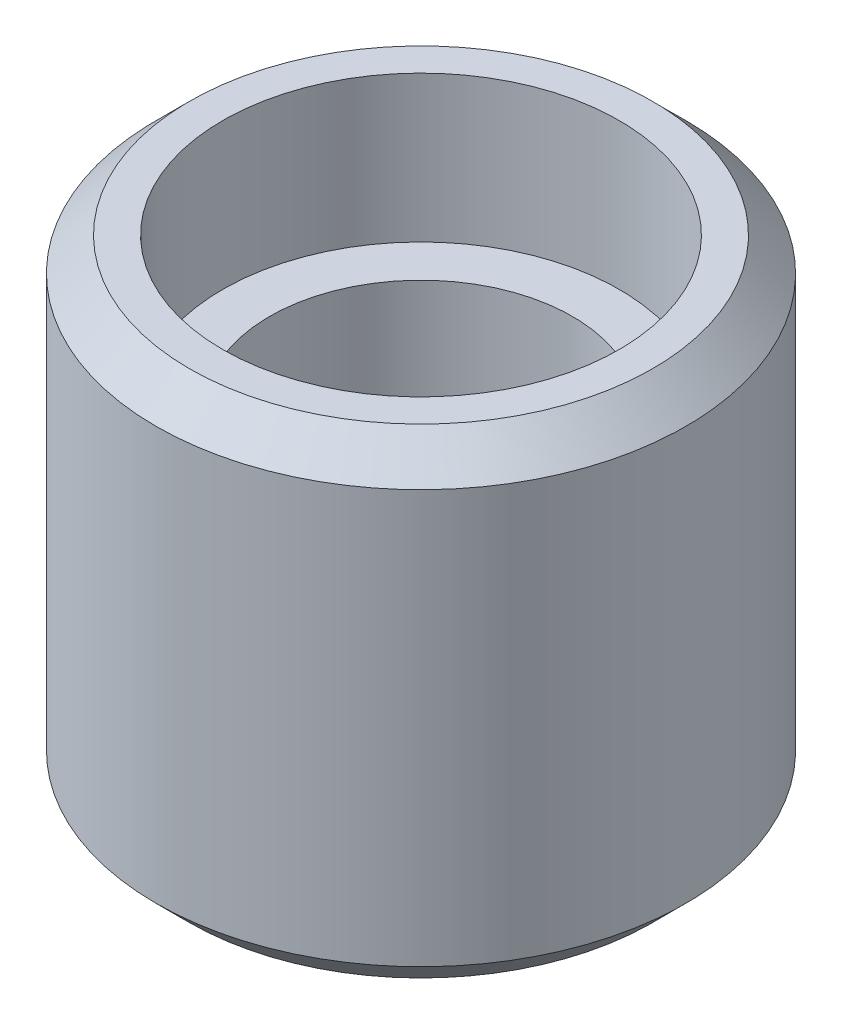
ISO-10303-21;
HEADER;
FILE_DESCRIPTION(('STEP AP214'),'2;1');
FILE_NAME('part.step','',(''),(''),'','','');
FILE_SCHEMA(('AUTOMOTIVE_DESIGN { 1 0 10303 214 1 1 1 1 }'));
ENDSEC;
DATA;
#1=APPLICATION_CONTEXT('core data for automotive mechanical design processes');
#2=APPLICATION_PROTOCOL_DEFINITION('international standard','automotive_design',2000,#1);
#3=PRODUCT_CONTEXT('',#1,'mechanical');
#4=PRODUCT('Part','Part','',(#3));
#5=PRODUCT_RELATED_PRODUCT_CATEGORY('part','',(#4));
#6=PRODUCT_DEFINITION_FORMATION('','',#4);
#7=PRODUCT_DEFINITION_CONTEXT('part definition',#1,'design');
#8=PRODUCT_DEFINITION('design','',#6,#7);
#9=PRODUCT_DEFINITION_SHAPE('','',#8);
#10=(LENGTH_UNIT() NAMED_UNIT(*) SI_UNIT(.MILLI.,.METRE.));
#11=(NAMED_UNIT(*) PLANE_ANGLE_UNIT() SI_UNIT($,.RADIAN.));
#12=(NAMED_UNIT(*) SI_UNIT($,.STERADIAN.) SOLID_ANGLE_UNIT());
#13=UNCERTAINTY_MEASURE_WITH_UNIT(LENGTH_MEASURE(1.E-05),#10,'distance_accuracy_value','');
#14=(GEOMETRIC_REPRESENTATION_CONTEXT(3) GLOBAL_UNCERTAINTY_ASSIGNED_CONTEXT((#13)) GLOBAL_UNIT_ASSIGNED_CONTEXT((#10,
#11,#12)) REPRESENTATION_CONTEXT('',''));
#15=CARTESIAN_POINT('',(0.,0.,0.));
#16=DIRECTION('',(0.,0.,1.));
#17=DIRECTION('',(1.,0.,0.));
#18=AXIS2_PLACEMENT_3D('',#15,#16,#17);
#19=CARTESIAN_POINT('',(0.,0.,0.));
#20=DIRECTION('',(0.,-1.,0.));
#21=DIRECTION('',(0.,0.,1.));
#22=AXIS2_PLACEMENT_3D('',#19,#20,#21);
#23=PLANE('',#22);
#24=CARTESIAN_POINT('',(0.,0.,0.));
#25=DIRECTION('',(0.,-1.,0.));
#26=DIRECTION('',(0.,0.,1.));
#27=AXIS2_PLACEMENT_3D('',#24,#25,#26);
#28=CIRCLE('',#27,12.95);
#29=CARTESIAN_POINT('',(0.,0.,12.95));
#30=VERTEX_POINT('',#29);
#31=EDGE_CURVE('E50',#30,#30,#28,.T.);
#32=ORIENTED_EDGE('',*,*,#31,.F.);
#33=EDGE_LOOP('',(#32));
#34=FACE_BOUND('',#33,.T.);
#35=CARTESIAN_POINT('',(0.,0.,0.));
#36=DIRECTION('',(0.,-1.,0.));
#37=DIRECTION('',(0.,0.,1.));
#38=AXIS2_PLACEMENT_3D('',#35,#36,#37);
#39=CIRCLE('',#38,19.795);
#40=CARTESIAN_POINT('',(0.,0.,19.795));
#41=VERTEX_POINT('',#40);
#42=EDGE_CURVE('E46',#41,#41,#39,.T.);
#43=ORIENTED_EDGE('',*,*,#42,.T.);
#44=EDGE_LOOP('',(#43));
#45=FACE_BOUND('',#44,.T.);
#46=ADVANCED_FACE('F15',(#34,#45),#23,.T.);
#47=CARTESIAN_POINT('',(0.,28.5,0.));
#48=DIRECTION('',(0.,-1.,0.));
#49=DIRECTION('',(0.,0.,1.));
#50=AXIS2_PLACEMENT_3D('',#47,#48,#49);
#51=PLANE('',#50);
#52=CARTESIAN_POINT('',(0.,28.5,0.));
#53=DIRECTION('',(0.,-1.,0.));
#54=DIRECTION('',(0.,0.,1.));
#55=AXIS2_PLACEMENT_3D('',#52,#53,#54);
#56=CIRCLE('',#55,12.95);
#57=CARTESIAN_POINT('',(0.,28.5,12.95));
#58=VERTEX_POINT('',#57);
#59=EDGE_CURVE('E18',#58,#58,#56,.T.);
#60=ORIENTED_EDGE('',*,*,#59,.T.);
#61=EDGE_LOOP('',(#60));
#62=FACE_BOUND('',#61,.T.);
#63=CARTESIAN_POINT('',(0.,28.5,0.));
#64=DIRECTION('',(0.,-1.,0.));
#65=DIRECTION('',(0.,0.,1.));
#66=AXIS2_PLACEMENT_3D('',#63,#64,#65);
#67=CIRCLE('',#66,16.95);
#68=CARTESIAN_POINT('',(0.,28.5,16.95));
#69=VERTEX_POINT('',#68);
#70=EDGE_CURVE('E10',#69,#69,#67,.T.);
#71=ORIENTED_EDGE('',*,*,#70,.F.);
#72=EDGE_LOOP('',(#71));
#73=FACE_BOUND('',#72,.T.);
#74=ADVANCED_FACE('F62',(#62,#73),#51,.F.);
#75=CARTESIAN_POINT('',(0.,0.,0.));
#76=DIRECTION('',(0.,-1.,0.));
#77=DIRECTION('',(0.,0.,1.));
#78=AXIS2_PLACEMENT_3D('',#75,#76,#77);
#79=CYLINDRICAL_SURFACE('',#78,16.95);
#80=CARTESIAN_POINT('',(0.,41.,0.));
#81=DIRECTION('',(0.,-1.,0.));
#82=DIRECTION('',(0.,0.,1.));
#83=AXIS2_PLACEMENT_3D('',#80,#81,#82);
#84=CIRCLE('',#83,16.95);
#85=CARTESIAN_POINT('',(0.,41.,16.95));
#86=VERTEX_POINT('',#85);
#87=EDGE_CURVE('E23',#86,#86,#84,.T.);
#88=ORIENTED_EDGE('',*,*,#87,.F.);
#89=EDGE_LOOP('',(#88));
#90=FACE_BOUND('',#89,.T.);
#91=ORIENTED_EDGE('',*,*,#70,.T.);
#92=EDGE_LOOP('',(#91));
#93=FACE_BOUND('',#92,.T.);
#94=ADVANCED_FACE('F81',(#90,#93),#79,.F.);
#95=CARTESIAN_POINT('',(-16.95,41.,0.));
#96=DIRECTION('',(0.,-1.,0.));
#97=DIRECTION('',(0.,0.,1.));
#98=AXIS2_PLACEMENT_3D('',#95,#96,#97);
#99=PLANE('',#98);
#100=CARTESIAN_POINT('',(0.,41.,0.));
#101=DIRECTION('',(0.,-1.,0.));
#102=DIRECTION('',(0.,0.,1.));
#103=AXIS2_PLACEMENT_3D('',#100,#101,#102);
#104=CIRCLE('',#103,19.795);
#105=CARTESIAN_POINT('',(0.,41.,19.795));
#106=VERTEX_POINT('',#105);
#107=EDGE_CURVE('E32',#106,#106,#104,.T.);
#108=ORIENTED_EDGE('',*,*,#107,.F.);
#109=EDGE_LOOP('',(#108));
#110=FACE_BOUND('',#109,.T.);
#111=ORIENTED_EDGE('',*,*,#87,.T.);
#112=EDGE_LOOP('',(#111));
#113=FACE_BOUND('',#112,.T.);
#114=ADVANCED_FACE('F88',(#110,#113),#99,.F.);
#115=CARTESIAN_POINT('',(0.,41.,0.));
#116=DIRECTION('',(0.,-1.,0.));
#117=DIRECTION('',(0.,0.,1.));
#118=AXIS2_PLACEMENT_3D('',#115,#116,#117);
#119=CONICAL_SURFACE('',#118,19.795,0.785398163397445);
#120=CARTESIAN_POINT('',(0.,38.155,0.));
#121=DIRECTION('',(0.,-1.,0.));
#122=DIRECTION('',(0.,0.,1.));
#123=AXIS2_PLACEMENT_3D('',#120,#121,#122);
#124=CIRCLE('',#123,22.64);
#125=CARTESIAN_POINT('',(0.,38.155,22.64));
#126=VERTEX_POINT('',#125);
#127=EDGE_CURVE('E38',#126,#126,#124,.T.);
#128=ORIENTED_EDGE('',*,*,#127,.F.);
#129=EDGE_LOOP('',(#128));
#130=FACE_BOUND('',#129,.T.);
#131=ORIENTED_EDGE('',*,*,#107,.T.);
#132=EDGE_LOOP('',(#131));
#133=FACE_BOUND('',#132,.T.);
#134=ADVANCED_FACE('F94',(#130,#133),#119,.T.);
#135=CARTESIAN_POINT('',(0.,0.,0.));
#136=DIRECTION('',(0.,-1.,0.));
#137=DIRECTION('',(0.,0.,1.));
#138=AXIS2_PLACEMENT_3D('',#135,#136,#137);
#139=CYLINDRICAL_SURFACE('',#138,22.64);
#140=ORIENTED_EDGE('',*,*,#127,.T.);
#141=EDGE_LOOP('',(#140));
#142=FACE_BOUND('',#141,.T.);
#143=CARTESIAN_POINT('',(0.,2.845,0.));
#144=DIRECTION('',(0.,-1.,0.));
#145=DIRECTION('',(0.,0.,1.));
#146=AXIS2_PLACEMENT_3D('',#143,#144,#145);
#147=CIRCLE('',#146,22.64);
#148=CARTESIAN_POINT('',(0.,2.845,22.64));
#149=VERTEX_POINT('',#148);
#150=EDGE_CURVE('E42',#149,#149,#147,.T.);
#151=ORIENTED_EDGE('',*,*,#150,.F.);
#152=EDGE_LOOP('',(#151));
#153=FACE_BOUND('',#152,.T.);
#154=ADVANCED_FACE('F73',(#142,#153),#139,.T.);
#155=CARTESIAN_POINT('',(0.,0.,0.));
#156=DIRECTION('',(0.,1.,0.));
#157=DIRECTION('',(0.,0.,-1.));
#158=AXIS2_PLACEMENT_3D('',#155,#156,#157);
#159=CONICAL_SURFACE('',#158,19.795,0.785398163397449);
#160=ORIENTED_EDGE('',*,*,#150,.T.);
#161=EDGE_LOOP('',(#160));
#162=FACE_BOUND('',#161,.T.);
#163=ORIENTED_EDGE('',*,*,#42,.F.);
#164=EDGE_LOOP('',(#163));
#165=FACE_BOUND('',#164,.T.);
#166=ADVANCED_FACE('F67',(#162,#165),#159,.T.);
#167=CARTESIAN_POINT('',(0.,-1.,0.));
#168=DIRECTION('',(0.,1.,0.));
#169=DIRECTION('',(1.,0.,0.));
#170=AXIS2_PLACEMENT_3D('',#167,#168,#169);
#171=CYLINDRICAL_SURFACE('',#170,12.95);
#172=ORIENTED_EDGE('',*,*,#31,.T.);
#173=EDGE_LOOP('',(#172));
#174=FACE_BOUND('',#173,.T.);
#175=ORIENTED_EDGE('',*,*,#59,.F.);
#176=EDGE_LOOP('',(#175));
#177=FACE_BOUND('',#176,.T.);
#178=ADVANCED_FACE('F65',(#174,#177),#171,.F.);
#179=CLOSED_SHELL('',(#46,#74,#94,#114,#134,#154,#166,#178));
#180=MANIFOLD_SOLID_BREP('B1',#179);
#181=ADVANCED_BREP_SHAPE_REPRESENTATION('',(#18,#180),#14);
#182=SHAPE_DEFINITION_REPRESENTATION(#9,#181);
ENDSEC;
END-ISO-10303-21;
